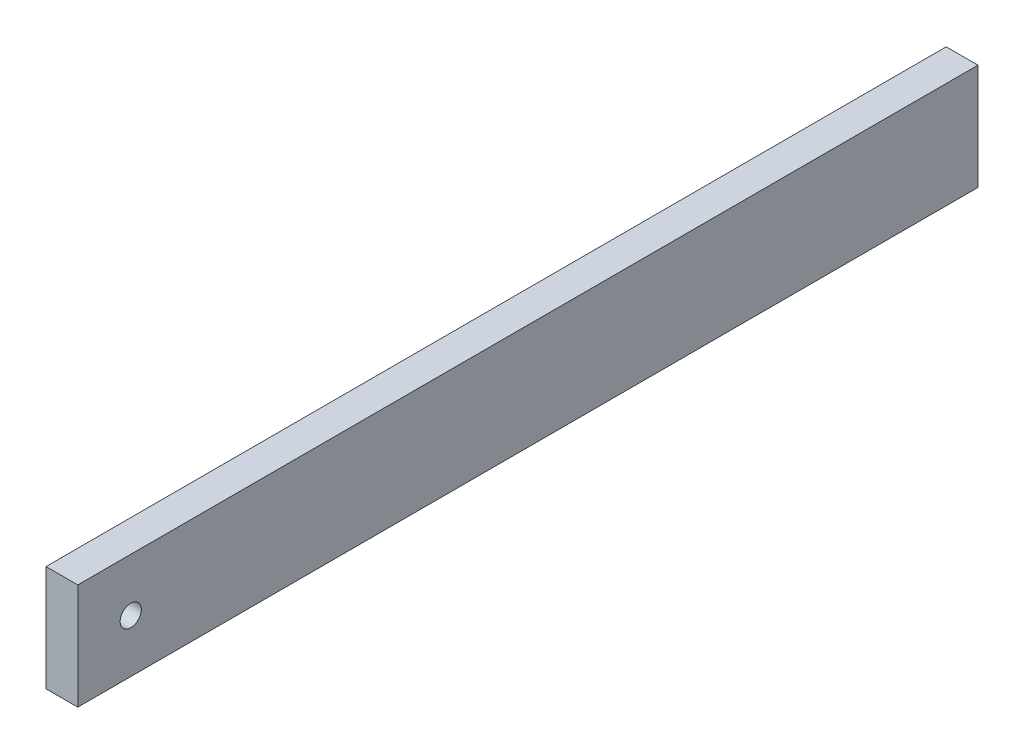
ISO-10303-21;
HEADER;
FILE_DESCRIPTION(('STEP AP214'),'2;1');
FILE_NAME('part.step','',(''),(''),'','','');
FILE_SCHEMA(('AUTOMOTIVE_DESIGN { 1 0 10303 214 1 1 1 1 }'));
ENDSEC;
DATA;
#1=APPLICATION_CONTEXT('core data for automotive mechanical design processes');
#2=APPLICATION_PROTOCOL_DEFINITION('international standard','automotive_design',2000,#1);
#3=PRODUCT_CONTEXT('',#1,'mechanical');
#4=PRODUCT('Part','Part','',(#3));
#5=PRODUCT_RELATED_PRODUCT_CATEGORY('part','',(#4));
#6=PRODUCT_DEFINITION_FORMATION('','',#4);
#7=PRODUCT_DEFINITION_CONTEXT('part definition',#1,'design');
#8=PRODUCT_DEFINITION('design','',#6,#7);
#9=PRODUCT_DEFINITION_SHAPE('','',#8);
#10=(LENGTH_UNIT() NAMED_UNIT(*) SI_UNIT(.MILLI.,.METRE.));
#11=(NAMED_UNIT(*) PLANE_ANGLE_UNIT() SI_UNIT($,.RADIAN.));
#12=(NAMED_UNIT(*) SI_UNIT($,.STERADIAN.) SOLID_ANGLE_UNIT());
#13=UNCERTAINTY_MEASURE_WITH_UNIT(LENGTH_MEASURE(1.E-05),#10,'distance_accuracy_value','');
#14=(GEOMETRIC_REPRESENTATION_CONTEXT(3) GLOBAL_UNCERTAINTY_ASSIGNED_CONTEXT((#13)) GLOBAL_UNIT_ASSIGNED_CONTEXT((#10,
#11,#12)) REPRESENTATION_CONTEXT('',''));
#15=CARTESIAN_POINT('',(0.,0.,0.));
#16=DIRECTION('',(0.,0.,1.));
#17=DIRECTION('',(1.,0.,0.));
#18=AXIS2_PLACEMENT_3D('',#15,#16,#17);
#19=CARTESIAN_POINT('',(3.,0.,0.));
#20=DIRECTION('',(-1.,0.,0.));
#21=DIRECTION('',(0.,0.,1.));
#22=AXIS2_PLACEMENT_3D('',#19,#20,#21);
#23=PLANE('',#22);
#24=DIRECTION('',(0.,-1.,0.));
#25=VECTOR('',#24,1.);
#26=CARTESIAN_POINT('',(3.,0.,0.));
#27=LINE('',#26,#25);
#28=CARTESIAN_POINT('',(3.,10.,0.));
#29=VERTEX_POINT('',#28);
#30=CARTESIAN_POINT('',(3.,0.,0.));
#31=VERTEX_POINT('',#30);
#32=EDGE_CURVE('E85',#29,#31,#27,.T.);
#33=ORIENTED_EDGE('',*,*,#32,.T.);
#34=DIRECTION('',(0.,0.,-1.));
#35=VECTOR('',#34,1.);
#36=CARTESIAN_POINT('',(3.,0.,0.));
#37=LINE('',#36,#35);
#38=CARTESIAN_POINT('',(3.,0.,-85.));
#39=VERTEX_POINT('',#38);
#40=EDGE_CURVE('E80',#31,#39,#37,.T.);
#41=ORIENTED_EDGE('',*,*,#40,.T.);
#42=DIRECTION('',(0.,1.,0.));
#43=VECTOR('',#42,1.);
#44=CARTESIAN_POINT('',(3.,0.,-85.));
#45=LINE('',#44,#43);
#46=CARTESIAN_POINT('',(3.,10.,-85.));
#47=VERTEX_POINT('',#46);
#48=EDGE_CURVE('E83',#39,#47,#45,.T.);
#49=ORIENTED_EDGE('',*,*,#48,.T.);
#50=DIRECTION('',(0.,0.,1.));
#51=VECTOR('',#50,1.);
#52=CARTESIAN_POINT('',(3.,10.,0.));
#53=LINE('',#52,#51);
#54=EDGE_CURVE('E50',#47,#29,#53,.T.);
#55=ORIENTED_EDGE('',*,*,#54,.T.);
#56=EDGE_LOOP('',(#33,#41,#49,#55));
#57=FACE_BOUND('',#56,.T.);
#58=CARTESIAN_POINT('',(3.,5.,-5.));
#59=DIRECTION('',(1.,0.,0.));
#60=DIRECTION('',(0.,0.,-1.));
#61=AXIS2_PLACEMENT_3D('',#58,#59,#60);
#62=CIRCLE('',#61,1.);
#63=CARTESIAN_POINT('',(3.,5.,-6.));
#64=VERTEX_POINT('',#63);
#65=EDGE_CURVE('E100',#64,#64,#62,.T.);
#66=ORIENTED_EDGE('',*,*,#65,.F.);
#67=EDGE_LOOP('',(#66));
#68=FACE_BOUND('',#67,.T.);
#69=ADVANCED_FACE('F33',(#57,#68),#23,.F.);
#70=CARTESIAN_POINT('',(0.,0.,0.));
#71=DIRECTION('',(-1.,0.,0.));
#72=DIRECTION('',(0.,0.,1.));
#73=AXIS2_PLACEMENT_3D('',#70,#71,#72);
#74=PLANE('',#73);
#75=DIRECTION('',(0.,-1.,0.));
#76=VECTOR('',#75,1.);
#77=CARTESIAN_POINT('',(0.,0.,0.));
#78=LINE('',#77,#76);
#79=CARTESIAN_POINT('',(0.,10.,0.));
#80=VERTEX_POINT('',#79);
#81=CARTESIAN_POINT('',(0.,0.,0.));
#82=VERTEX_POINT('',#81);
#83=EDGE_CURVE('E97',#80,#82,#78,.T.);
#84=ORIENTED_EDGE('',*,*,#83,.F.);
#85=DIRECTION('',(0.,0.,1.));
#86=VECTOR('',#85,1.);
#87=CARTESIAN_POINT('',(0.,10.,0.));
#88=LINE('',#87,#86);
#89=CARTESIAN_POINT('',(0.,10.,-85.));
#90=VERTEX_POINT('',#89);
#91=EDGE_CURVE('E73',#90,#80,#88,.T.);
#92=ORIENTED_EDGE('',*,*,#91,.F.);
#93=DIRECTION('',(0.,1.,0.));
#94=VECTOR('',#93,1.);
#95=CARTESIAN_POINT('',(0.,0.,-85.));
#96=LINE('',#95,#94);
#97=CARTESIAN_POINT('',(0.,0.,-85.));
#98=VERTEX_POINT('',#97);
#99=EDGE_CURVE('E67',#98,#90,#96,.T.);
#100=ORIENTED_EDGE('',*,*,#99,.F.);
#101=DIRECTION('',(0.,0.,-1.));
#102=VECTOR('',#101,1.);
#103=CARTESIAN_POINT('',(0.,0.,0.));
#104=LINE('',#103,#102);
#105=EDGE_CURVE('E89',#82,#98,#104,.T.);
#106=ORIENTED_EDGE('',*,*,#105,.F.);
#107=EDGE_LOOP('',(#84,#92,#100,#106));
#108=FACE_BOUND('',#107,.T.);
#109=CARTESIAN_POINT('',(0.,5.,-5.));
#110=DIRECTION('',(1.,0.,0.));
#111=DIRECTION('',(0.,0.,-1.));
#112=AXIS2_PLACEMENT_3D('',#109,#110,#111);
#113=CIRCLE('',#112,1.);
#114=CARTESIAN_POINT('',(0.,5.,-6.));
#115=VERTEX_POINT('',#114);
#116=EDGE_CURVE('E112',#115,#115,#113,.T.);
#117=ORIENTED_EDGE('',*,*,#116,.T.);
#118=EDGE_LOOP('',(#117));
#119=FACE_BOUND('',#118,.T.);
#120=ADVANCED_FACE('F108',(#108,#119),#74,.T.);
#121=CARTESIAN_POINT('',(3.,0.,0.));
#122=DIRECTION('',(0.,0.,-1.));
#123=DIRECTION('',(-1.,0.,0.));
#124=AXIS2_PLACEMENT_3D('',#121,#122,#123);
#125=PLANE('',#124);
#126=ORIENTED_EDGE('',*,*,#83,.T.);
#127=DIRECTION('',(-1.,0.,0.));
#128=VECTOR('',#127,1.);
#129=CARTESIAN_POINT('',(3.,0.,0.));
#130=LINE('',#129,#128);
#131=EDGE_CURVE('E11',#31,#82,#130,.T.);
#132=ORIENTED_EDGE('',*,*,#131,.F.);
#133=ORIENTED_EDGE('',*,*,#32,.F.);
#134=DIRECTION('',(-1.,0.,0.));
#135=VECTOR('',#134,1.);
#136=CARTESIAN_POINT('',(3.,10.,0.));
#137=LINE('',#136,#135);
#138=EDGE_CURVE('E93',#29,#80,#137,.T.);
#139=ORIENTED_EDGE('',*,*,#138,.T.);
#140=EDGE_LOOP('',(#126,#132,#133,#139));
#141=FACE_BOUND('',#140,.T.);
#142=ADVANCED_FACE('F35',(#141),#125,.F.);
#143=CARTESIAN_POINT('',(3.,0.,0.));
#144=DIRECTION('',(0.,1.,0.));
#145=DIRECTION('',(0.,0.,1.));
#146=AXIS2_PLACEMENT_3D('',#143,#144,#145);
#147=PLANE('',#146);
#148=ORIENTED_EDGE('',*,*,#105,.T.);
#149=DIRECTION('',(-1.,0.,0.));
#150=VECTOR('',#149,1.);
#151=CARTESIAN_POINT('',(3.,0.,-85.));
#152=LINE('',#151,#150);
#153=EDGE_CURVE('E42',#39,#98,#152,.T.);
#154=ORIENTED_EDGE('',*,*,#153,.F.);
#155=ORIENTED_EDGE('',*,*,#40,.F.);
#156=ORIENTED_EDGE('',*,*,#131,.T.);
#157=EDGE_LOOP('',(#148,#154,#155,#156));
#158=FACE_BOUND('',#157,.T.);
#159=ADVANCED_FACE('F88',(#158),#147,.F.);
#160=CARTESIAN_POINT('',(3.,0.,-85.));
#161=DIRECTION('',(0.,0.,1.));
#162=DIRECTION('',(1.,0.,0.));
#163=AXIS2_PLACEMENT_3D('',#160,#161,#162);
#164=PLANE('',#163);
#165=ORIENTED_EDGE('',*,*,#99,.T.);
#166=DIRECTION('',(-1.,0.,0.));
#167=VECTOR('',#166,1.);
#168=CARTESIAN_POINT('',(3.,10.,-85.));
#169=LINE('',#168,#167);
#170=EDGE_CURVE('E90',#47,#90,#169,.T.);
#171=ORIENTED_EDGE('',*,*,#170,.F.);
#172=ORIENTED_EDGE('',*,*,#48,.F.);
#173=ORIENTED_EDGE('',*,*,#153,.T.);
#174=EDGE_LOOP('',(#165,#171,#172,#173));
#175=FACE_BOUND('',#174,.T.);
#176=ADVANCED_FACE('F91',(#175),#164,.F.);
#177=CARTESIAN_POINT('',(3.,10.,0.));
#178=DIRECTION('',(0.,-1.,0.));
#179=DIRECTION('',(0.,0.,-1.));
#180=AXIS2_PLACEMENT_3D('',#177,#178,#179);
#181=PLANE('',#180);
#182=ORIENTED_EDGE('',*,*,#91,.T.);
#183=ORIENTED_EDGE('',*,*,#138,.F.);
#184=ORIENTED_EDGE('',*,*,#54,.F.);
#185=ORIENTED_EDGE('',*,*,#170,.T.);
#186=EDGE_LOOP('',(#182,#183,#184,#185));
#187=FACE_BOUND('',#186,.T.);
#188=ADVANCED_FACE('F105',(#187),#181,.F.);
#189=CARTESIAN_POINT('',(3.,5.,-5.));
#190=DIRECTION('',(-1.,0.,0.));
#191=DIRECTION('',(0.,0.,1.));
#192=AXIS2_PLACEMENT_3D('',#189,#190,#191);
#193=CYLINDRICAL_SURFACE('',#192,1.);
#194=ORIENTED_EDGE('',*,*,#65,.T.);
#195=EDGE_LOOP('',(#194));
#196=FACE_BOUND('',#195,.T.);
#197=ORIENTED_EDGE('',*,*,#116,.F.);
#198=EDGE_LOOP('',(#197));
#199=FACE_BOUND('',#198,.T.);
#200=ADVANCED_FACE('F118',(#196,#199),#193,.F.);
#201=CLOSED_SHELL('',(#69,#120,#142,#159,#176,#188,#200));
#202=MANIFOLD_SOLID_BREP('B2',#201);
#203=ADVANCED_BREP_SHAPE_REPRESENTATION('',(#18,#202),#14);
#204=SHAPE_DEFINITION_REPRESENTATION(#9,#203);
ENDSEC;
END-ISO-10303-21;
